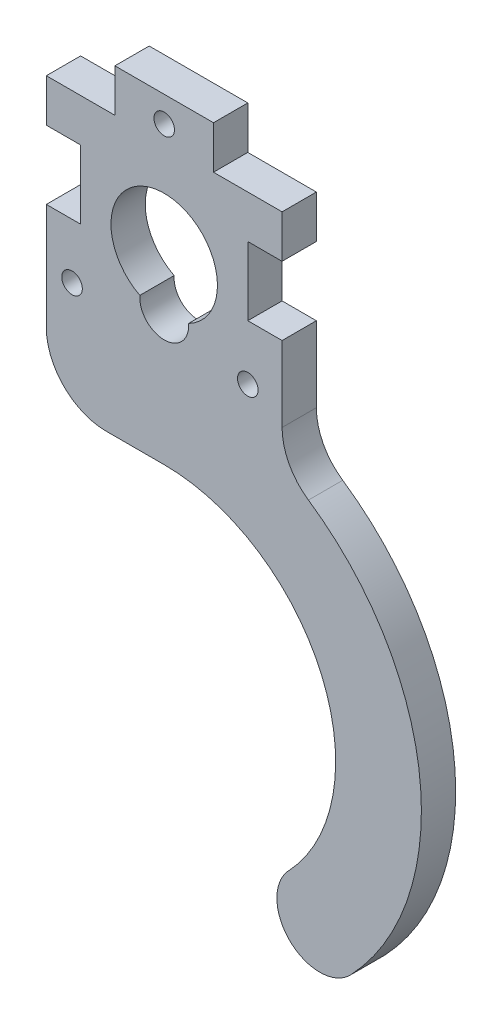
ISO-10303-21;
HEADER;
FILE_DESCRIPTION(('STEP AP214'),'2;1');
FILE_NAME('part.step','',(''),(''),'','','');
FILE_SCHEMA(('AUTOMOTIVE_DESIGN { 1 0 10303 214 1 1 1 1 }'));
ENDSEC;
DATA;
#1=APPLICATION_CONTEXT('core data for automotive mechanical design processes');
#2=APPLICATION_PROTOCOL_DEFINITION('international standard','automotive_design',2000,#1);
#3=PRODUCT_CONTEXT('',#1,'mechanical');
#4=PRODUCT('Part','Part','',(#3));
#5=PRODUCT_RELATED_PRODUCT_CATEGORY('part','',(#4));
#6=PRODUCT_DEFINITION_FORMATION('','',#4);
#7=PRODUCT_DEFINITION_CONTEXT('part definition',#1,'design');
#8=PRODUCT_DEFINITION('design','',#6,#7);
#9=PRODUCT_DEFINITION_SHAPE('','',#8);
#10=(LENGTH_UNIT() NAMED_UNIT(*) SI_UNIT(.MILLI.,.METRE.));
#11=(NAMED_UNIT(*) PLANE_ANGLE_UNIT() SI_UNIT($,.RADIAN.));
#12=(NAMED_UNIT(*) SI_UNIT($,.STERADIAN.) SOLID_ANGLE_UNIT());
#13=UNCERTAINTY_MEASURE_WITH_UNIT(LENGTH_MEASURE(1.E-05),#10,'distance_accuracy_value','');
#14=(GEOMETRIC_REPRESENTATION_CONTEXT(3) GLOBAL_UNCERTAINTY_ASSIGNED_CONTEXT((#13)) GLOBAL_UNIT_ASSIGNED_CONTEXT((#10,
#11,#12)) REPRESENTATION_CONTEXT('',''));
#15=CARTESIAN_POINT('',(0.,0.,0.));
#16=DIRECTION('',(0.,0.,1.));
#17=DIRECTION('',(1.,0.,0.));
#18=AXIS2_PLACEMENT_3D('',#15,#16,#17);
#19=CARTESIAN_POINT('',(35.5245474362626,-40.6365957450823,4.4));
#20=CARTESIAN_POINT('',(35.5245474362626,-40.6365957450823,4.26666666666604));
#21=CARTESIAN_POINT('',(35.5245474362636,-40.6365957450813,4.13333333333416));
#22=CARTESIAN_POINT('',(35.5245474362636,-40.6365957450813,2.66666666665839));
#23=CARTESIAN_POINT('',(35.5245474362636,-40.6365957450813,1.33333333333336));
#24=CARTESIAN_POINT('',(35.5245474362636,-40.6365957450813,-0.133333333333336));
#25=CARTESIAN_POINT('',(35.5245474362626,-40.6365957450823,-0.266666666666663));
#26=CARTESIAN_POINT('',(35.5245474362626,-40.6365957450823,-0.400000000000001));
#27=CARTESIAN_POINT('',(33.2315923534757,-43.0559899046674,4.4));
#28=CARTESIAN_POINT('',(33.2315923534757,-43.0559899046674,4.26666666666635));
#29=CARTESIAN_POINT('',(33.231592353477,-43.0559899046671,4.13333333333376));
#30=CARTESIAN_POINT('',(33.231592353477,-43.0559899046671,2.66666666666244));
#31=CARTESIAN_POINT('',(33.231592353477,-43.0559899046671,1.33333333333336));
#32=CARTESIAN_POINT('',(33.231592353477,-43.0559899046671,-0.133333333333336));
#33=CARTESIAN_POINT('',(33.2315923534757,-43.0559899046674,-0.266666666666663));
#34=CARTESIAN_POINT('',(33.2315923534757,-43.0559899046674,-0.400000000000001));
#35=CARTESIAN_POINT('',(28.5508528803031,-44.3605162920587,4.4));
#36=CARTESIAN_POINT('',(28.5508528803031,-44.3605162920587,4.266666666667));
#37=CARTESIAN_POINT('',(28.5508528803039,-44.3605162920594,4.13333333333289));
#38=CARTESIAN_POINT('',(28.5508528803013,-44.3605162920645,2.66666666667111));
#39=CARTESIAN_POINT('',(28.5508528803036,-44.3605162920598,1.33333333333336));
#40=CARTESIAN_POINT('',(28.5508528803036,-44.3605162920598,-0.133333333333336));
#41=CARTESIAN_POINT('',(28.5508528803031,-44.3605162920587,-0.266666666666663));
#42=CARTESIAN_POINT('',(28.5508528803031,-44.3605162920587,-0.400000000000001));
#43=CARTESIAN_POINT('',(24.9217616409256,-40.921083667878,4.4));
#44=CARTESIAN_POINT('',(24.9217616409256,-40.921083667878,4.26666666666748));
#45=CARTESIAN_POINT('',(24.9217616409262,-40.9210836678782,4.13333333333225));
#46=CARTESIAN_POINT('',(24.9217616409135,-40.9210836678833,2.66666666667747));
#47=CARTESIAN_POINT('',(24.921761640925,-40.9210836678787,1.33333333333336));
#48=CARTESIAN_POINT('',(24.921761640925,-40.9210836678787,-0.133333333333336));
#49=CARTESIAN_POINT('',(24.9217616409256,-40.921083667878,-0.266666666666663));
#50=CARTESIAN_POINT('',(24.9217616409256,-40.921083667878,-0.400000000000001));
#51=CARTESIAN_POINT('',(25.9734098747211,-36.1771246563064,4.4));
#52=CARTESIAN_POINT('',(25.9734098747211,-36.1771246563064,4.26666666666731));
#53=CARTESIAN_POINT('',(25.9734098747214,-36.1771246563061,4.13333333333248));
#54=CARTESIAN_POINT('',(25.9734098747188,-36.1771246563061,2.66666666667516));
#55=CARTESIAN_POINT('',(25.9734098747211,-36.1771246563061,1.33333333333336));
#56=CARTESIAN_POINT('',(25.9734098747211,-36.1771246563061,-0.133333333333336));
#57=CARTESIAN_POINT('',(25.9734098747211,-36.1771246563064,-0.266666666666663));
#58=CARTESIAN_POINT('',(25.9734098747211,-36.1771246563064,-0.400000000000001));
#59=CARTESIAN_POINT('',(28.2663649575083,-33.7577304967217,4.4));
#60=CARTESIAN_POINT('',(28.2663649575083,-33.7577304967217,4.266666666667));
#61=CARTESIAN_POINT('',(28.2663649575087,-33.7577304967212,4.13333333333289));
#62=CARTESIAN_POINT('',(28.2663649575087,-33.7577304967212,2.66666666667111));
#63=CARTESIAN_POINT('',(28.2663649575087,-33.7577304967212,1.33333333333336));
#64=CARTESIAN_POINT('',(28.2663649575087,-33.7577304967212,-0.133333333333336));
#65=CARTESIAN_POINT('',(28.2663649575083,-33.7577304967217,-0.266666666666663));
#66=CARTESIAN_POINT('',(28.2663649575083,-33.7577304967217,-0.400000000000001));
#67=(BOUNDED_SURFACE() B_SPLINE_SURFACE(5,3,((#19,#20,#21,#22,#23,#24,#25,#26),(#27,#28,#29,#30,
#31,#32,#33,#34),(#35,#36,#37,#38,#39,#40,#41,#42),(#43,#44,#45,#46,#47,#48,#49,#50),(#51,#52,
#53,#54,#55,#56,#57,#58),(#59,#60,#61,#62,#63,#64,#65,#66)),.UNSPECIFIED.,.F.,.F.,
.F.) B_SPLINE_SURFACE_WITH_KNOTS((6,6),(4,2,2,4),(0.,1.),(-0.1,0.,1.,1.1),
.UNSPECIFIED.) GEOMETRIC_REPRESENTATION_ITEM() RATIONAL_B_SPLINE_SURFACE(((1.,1.,1.,1.,1.,1.,1.,
1.),(0.599999999999972,0.599999999999972,0.599999999999916,0.599999999999916,0.599999999999916,
0.599999999999916,0.599999999999972,0.599999999999972),(0.399999999999959,0.399999999999959,
0.399999999999875,0.399999999999875,0.399999999999875,0.399999999999875,0.399999999999959,
0.399999999999959),(0.399999999999959,0.399999999999959,0.399999999999875,0.399999999999875,
0.399999999999875,0.399999999999875,0.399999999999959,0.399999999999959),(0.599999999999972,
0.599999999999972,0.599999999999916,0.599999999999916,0.599999999999916,0.599999999999916,
0.599999999999972,0.599999999999972),(1.,1.,1.,1.,1.,1.,1.,1.))) REPRESENTATION_ITEM('') SURFACE());
#68=CARTESIAN_POINT('',(35.5245474362626,-40.6365957450823,-0.400000000000001));
#69=CARTESIAN_POINT('',(35.5245474362626,-40.6365957450823,-0.266666666666663));
#70=CARTESIAN_POINT('',(35.5245474362636,-40.6365957450813,-0.133333333333336));
#71=CARTESIAN_POINT('',(35.5245474362636,-40.6365957450813,1.33333333333336));
#72=CARTESIAN_POINT('',(35.5245474362636,-40.6365957450813,2.66666666665839));
#73=CARTESIAN_POINT('',(35.5245474362636,-40.6365957450813,4.13333333333416));
#74=CARTESIAN_POINT('',(35.5245474362626,-40.6365957450823,4.26666666666604));
#75=CARTESIAN_POINT('',(35.5245474362626,-40.6365957450823,4.4));
#76=(BOUNDED_CURVE() B_SPLINE_CURVE(3,(#68,#69,#70,#71,#72,#73,#74,#75),.UNSPECIFIED.,.F.,
.F.) B_SPLINE_CURVE_WITH_KNOTS((4,2,2,4),(-0.1,0.,1.,1.1),
.UNSPECIFIED.) CURVE() GEOMETRIC_REPRESENTATION_ITEM() RATIONAL_B_SPLINE_CURVE((1.,1.,1.,1.,1.,
1.,1.,1.)) REPRESENTATION_ITEM(''));
#77=CARTESIAN_POINT('',(35.5245474362636,-40.6365957450813,4.));
#78=VERTEX_POINT('',#77);
#79=CARTESIAN_POINT('',(35.5245474362636,-40.6365957450813,0.));
#80=VERTEX_POINT('',#79);
#81=EDGE_CURVE('E411',#78,#80,#76,.F.);
#82=CARTESIAN_POINT('',(35.5245474362636,-40.6365957450813,4.));
#83=CARTESIAN_POINT('',(33.231592353477,-43.0559899046671,4.));
#84=CARTESIAN_POINT('',(28.5508528803036,-44.3605162920598,4.));
#85=CARTESIAN_POINT('',(24.921761640925,-40.9210836678787,4.));
#86=CARTESIAN_POINT('',(25.9734098747211,-36.1771246563061,4.));
#87=CARTESIAN_POINT('',(28.2663649575087,-33.7577304967212,4.));
#88=(BOUNDED_CURVE() B_SPLINE_CURVE(5,(#82,#83,#84,#85,#86,#87),.UNSPECIFIED.,.F.,
.F.) B_SPLINE_CURVE_WITH_KNOTS((6,6),(0.,1.),
.UNSPECIFIED.) CURVE() GEOMETRIC_REPRESENTATION_ITEM() RATIONAL_B_SPLINE_CURVE((1.,
0.599999999999916,0.399999999999875,0.399999999999875,0.599999999999916,1.)) REPRESENTATION_ITEM(''));
#89=CARTESIAN_POINT('',(28.2663649575087,-33.7577304967212,4.));
#90=VERTEX_POINT('',#89);
#91=EDGE_CURVE('E55',#90,#78,#88,.F.);
#92=CARTESIAN_POINT('',(28.2663649575083,-33.7577304967217,4.4));
#93=CARTESIAN_POINT('',(28.2663649575083,-33.7577304967217,4.266666666667));
#94=CARTESIAN_POINT('',(28.2663649575087,-33.7577304967212,4.13333333333289));
#95=CARTESIAN_POINT('',(28.2663649575087,-33.7577304967212,2.66666666667111));
#96=CARTESIAN_POINT('',(28.2663649575087,-33.7577304967212,1.33333333333336));
#97=CARTESIAN_POINT('',(28.2663649575087,-33.7577304967212,-0.133333333333336));
#98=CARTESIAN_POINT('',(28.2663649575083,-33.7577304967217,-0.266666666666663));
#99=CARTESIAN_POINT('',(28.2663649575083,-33.7577304967217,-0.400000000000001));
#100=(BOUNDED_CURVE() B_SPLINE_CURVE(3,(#92,#93,#94,#95,#96,#97,#98,#99),.UNSPECIFIED.,.F.,
.F.) B_SPLINE_CURVE_WITH_KNOTS((4,2,2,4),(-0.1,0.,1.,1.1),
.UNSPECIFIED.) CURVE() GEOMETRIC_REPRESENTATION_ITEM() RATIONAL_B_SPLINE_CURVE((1.,1.,1.,1.,1.,
1.,1.,1.)) REPRESENTATION_ITEM(''));
#101=CARTESIAN_POINT('',(28.2663649575087,-33.7577304967212,0.));
#102=VERTEX_POINT('',#101);
#103=EDGE_CURVE('E310',#102,#90,#100,.F.);
#104=CARTESIAN_POINT('',(28.2663649575087,-33.7577304967212,0.));
#105=CARTESIAN_POINT('',(25.9734098747211,-36.1771246563061,0.));
#106=CARTESIAN_POINT('',(24.921761640925,-40.9210836678787,0.));
#107=CARTESIAN_POINT('',(28.5508528803036,-44.3605162920598,0.));
#108=CARTESIAN_POINT('',(33.231592353477,-43.0559899046671,0.));
#109=CARTESIAN_POINT('',(35.5245474362636,-40.6365957450813,0.));
#110=(BOUNDED_CURVE() B_SPLINE_CURVE(5,(#104,#105,#106,#107,#108,#109),.UNSPECIFIED.,.F.,
.F.) B_SPLINE_CURVE_WITH_KNOTS((6,6),(0.,1.),
.UNSPECIFIED.) CURVE() GEOMETRIC_REPRESENTATION_ITEM() RATIONAL_B_SPLINE_CURVE((1.,
0.599999999999916,0.399999999999875,0.399999999999875,0.599999999999916,1.)) REPRESENTATION_ITEM(''));
#111=EDGE_CURVE('E11',#80,#102,#110,.F.);
#112=ORIENTED_EDGE('',*,*,#81,.F.);
#113=ORIENTED_EDGE('',*,*,#91,.F.);
#114=ORIENTED_EDGE('',*,*,#103,.F.);
#115=ORIENTED_EDGE('',*,*,#111,.F.);
#116=EDGE_LOOP('',(#112,#113,#114,#115));
#117=FACE_BOUND('',#116,.T.);
#118=ADVANCED_FACE('F41',(#117),#67,.T.);
#119=CARTESIAN_POINT('',(23.5,0.,4.));
#120=DIRECTION('',(1.,0.,0.));
#121=DIRECTION('',(0.,1.,0.));
#122=AXIS2_PLACEMENT_3D('',#119,#120,#121);
#123=PLANE('',#122);
#124=DIRECTION('',(0.,-1.,0.));
#125=VECTOR('',#124,1.);
#126=CARTESIAN_POINT('',(23.5,0.,0.));
#127=LINE('',#126,#125);
#128=CARTESIAN_POINT('',(23.5,27.42,0.));
#129=VERTEX_POINT('',#128);
#130=CARTESIAN_POINT('',(23.5,19.42,0.));
#131=VERTEX_POINT('',#130);
#132=EDGE_CURVE('E557',#129,#131,#127,.T.);
#133=ORIENTED_EDGE('',*,*,#132,.F.);
#134=DIRECTION('',(0.,0.,-1.));
#135=VECTOR('',#134,1.);
#136=CARTESIAN_POINT('',(23.5,27.42,4.));
#137=LINE('',#136,#135);
#138=CARTESIAN_POINT('',(23.5,27.42,4.));
#139=VERTEX_POINT('',#138);
#140=EDGE_CURVE('E498',#139,#129,#137,.T.);
#141=ORIENTED_EDGE('',*,*,#140,.F.);
#142=DIRECTION('',(0.,-1.,0.));
#143=VECTOR('',#142,1.);
#144=CARTESIAN_POINT('',(23.5,0.,4.));
#145=LINE('',#144,#143);
#146=CARTESIAN_POINT('',(23.5,19.42,4.));
#147=VERTEX_POINT('',#146);
#148=EDGE_CURVE('E241',#139,#147,#145,.T.);
#149=ORIENTED_EDGE('',*,*,#148,.T.);
#150=DIRECTION('',(0.,0.,-1.));
#151=VECTOR('',#150,1.);
#152=CARTESIAN_POINT('',(23.5,19.42,4.));
#153=LINE('',#152,#151);
#154=EDGE_CURVE('E214',#147,#131,#153,.T.);
#155=ORIENTED_EDGE('',*,*,#154,.T.);
#156=EDGE_LOOP('',(#133,#141,#149,#155));
#157=FACE_BOUND('',#156,.T.);
#158=ADVANCED_FACE('F374',(#157),#123,.T.);
#159=CARTESIAN_POINT('',(0.,27.42,4.));
#160=DIRECTION('',(0.,-1.,0.));
#161=DIRECTION('',(0.,0.,-1.));
#162=AXIS2_PLACEMENT_3D('',#159,#160,#161);
#163=PLANE('',#162);
#164=DIRECTION('',(-1.,0.,0.));
#165=VECTOR('',#164,1.);
#166=CARTESIAN_POINT('',(0.,27.42,0.));
#167=LINE('',#166,#165);
#168=CARTESIAN_POINT('',(27.5,27.42,0.));
#169=VERTEX_POINT('',#168);
#170=EDGE_CURVE('E560',#169,#129,#167,.T.);
#171=ORIENTED_EDGE('',*,*,#170,.F.);
#172=DIRECTION('',(0.,0.,-1.));
#173=VECTOR('',#172,1.);
#174=CARTESIAN_POINT('',(27.5,27.42,4.));
#175=LINE('',#174,#173);
#176=CARTESIAN_POINT('',(27.5,27.42,4.));
#177=VERTEX_POINT('',#176);
#178=EDGE_CURVE('E495',#177,#169,#175,.T.);
#179=ORIENTED_EDGE('',*,*,#178,.F.);
#180=DIRECTION('',(-1.,0.,0.));
#181=VECTOR('',#180,1.);
#182=CARTESIAN_POINT('',(0.,27.42,4.));
#183=LINE('',#182,#181);
#184=EDGE_CURVE('E245',#177,#139,#183,.T.);
#185=ORIENTED_EDGE('',*,*,#184,.T.);
#186=ORIENTED_EDGE('',*,*,#140,.T.);
#187=EDGE_LOOP('',(#171,#179,#185,#186));
#188=FACE_BOUND('',#187,.T.);
#189=ADVANCED_FACE('F371',(#188),#163,.T.);
#190=CARTESIAN_POINT('',(27.5,0.,4.));
#191=DIRECTION('',(-1.,0.,0.));
#192=DIRECTION('',(0.,0.,1.));
#193=AXIS2_PLACEMENT_3D('',#190,#191,#192);
#194=PLANE('',#193);
#195=DIRECTION('',(0.,1.,0.));
#196=VECTOR('',#195,1.);
#197=CARTESIAN_POINT('',(27.5,0.,0.));
#198=LINE('',#197,#196);
#199=CARTESIAN_POINT('',(27.5,32.42,0.));
#200=VERTEX_POINT('',#199);
#201=EDGE_CURVE('E564',#169,#200,#198,.T.);
#202=ORIENTED_EDGE('',*,*,#201,.T.);
#203=DIRECTION('',(0.,0.,-1.));
#204=VECTOR('',#203,1.);
#205=CARTESIAN_POINT('',(27.5,32.42,4.));
#206=LINE('',#205,#204);
#207=CARTESIAN_POINT('',(27.5,32.42,4.));
#208=VERTEX_POINT('',#207);
#209=EDGE_CURVE('E491',#208,#200,#206,.T.);
#210=ORIENTED_EDGE('',*,*,#209,.F.);
#211=DIRECTION('',(0.,1.,0.));
#212=VECTOR('',#211,1.);
#213=CARTESIAN_POINT('',(27.5,0.,4.));
#214=LINE('',#213,#212);
#215=EDGE_CURVE('E249',#177,#208,#214,.T.);
#216=ORIENTED_EDGE('',*,*,#215,.F.);
#217=ORIENTED_EDGE('',*,*,#178,.T.);
#218=EDGE_LOOP('',(#202,#210,#216,#217));
#219=FACE_BOUND('',#218,.T.);
#220=ADVANCED_FACE('F369',(#219),#194,.F.);
#221=CARTESIAN_POINT('',(0.,32.42,4.));
#222=DIRECTION('',(0.,-1.,0.));
#223=DIRECTION('',(0.,0.,-1.));
#224=AXIS2_PLACEMENT_3D('',#221,#222,#223);
#225=PLANE('',#224);
#226=DIRECTION('',(-1.,0.,0.));
#227=VECTOR('',#226,1.);
#228=CARTESIAN_POINT('',(0.,32.42,0.));
#229=LINE('',#228,#227);
#230=CARTESIAN_POINT('',(19.5,32.42,0.));
#231=VERTEX_POINT('',#230);
#232=EDGE_CURVE('E568',#200,#231,#229,.T.);
#233=ORIENTED_EDGE('',*,*,#232,.T.);
#234=DIRECTION('',(0.,0.,-1.));
#235=VECTOR('',#234,1.);
#236=CARTESIAN_POINT('',(19.5,32.42,4.));
#237=LINE('',#236,#235);
#238=CARTESIAN_POINT('',(19.5,32.42,4.));
#239=VERTEX_POINT('',#238);
#240=EDGE_CURVE('E488',#239,#231,#237,.T.);
#241=ORIENTED_EDGE('',*,*,#240,.F.);
#242=DIRECTION('',(-1.,0.,0.));
#243=VECTOR('',#242,1.);
#244=CARTESIAN_POINT('',(0.,32.42,4.));
#245=LINE('',#244,#243);
#246=EDGE_CURVE('E253',#208,#239,#245,.T.);
#247=ORIENTED_EDGE('',*,*,#246,.F.);
#248=ORIENTED_EDGE('',*,*,#209,.T.);
#249=EDGE_LOOP('',(#233,#241,#247,#248));
#250=FACE_BOUND('',#249,.T.);
#251=ADVANCED_FACE('F365',(#250),#225,.F.);
#252=CARTESIAN_POINT('',(19.5,0.,4.));
#253=DIRECTION('',(1.,0.,0.));
#254=DIRECTION('',(0.,0.,-1.));
#255=AXIS2_PLACEMENT_3D('',#252,#253,#254);
#256=PLANE('',#255);
#257=DIRECTION('',(0.,-1.,0.));
#258=VECTOR('',#257,1.);
#259=CARTESIAN_POINT('',(19.5,0.,0.));
#260=LINE('',#259,#258);
#261=CARTESIAN_POINT('',(19.5,37.42,0.));
#262=VERTEX_POINT('',#261);
#263=EDGE_CURVE('E572',#262,#231,#260,.T.);
#264=ORIENTED_EDGE('',*,*,#263,.F.);
#265=DIRECTION('',(0.,0.,-1.));
#266=VECTOR('',#265,1.);
#267=CARTESIAN_POINT('',(19.5,37.42,4.));
#268=LINE('',#267,#266);
#269=CARTESIAN_POINT('',(19.5,37.42,4.));
#270=VERTEX_POINT('',#269);
#271=EDGE_CURVE('E485',#270,#262,#268,.T.);
#272=ORIENTED_EDGE('',*,*,#271,.F.);
#273=DIRECTION('',(0.,-1.,0.));
#274=VECTOR('',#273,1.);
#275=CARTESIAN_POINT('',(19.5,0.,4.));
#276=LINE('',#275,#274);
#277=EDGE_CURVE('E257',#270,#239,#276,.T.);
#278=ORIENTED_EDGE('',*,*,#277,.T.);
#279=ORIENTED_EDGE('',*,*,#240,.T.);
#280=EDGE_LOOP('',(#264,#272,#278,#279));
#281=FACE_BOUND('',#280,.T.);
#282=ADVANCED_FACE('F361',(#281),#256,.T.);
#283=CARTESIAN_POINT('',(0.,37.42,4.));
#284=DIRECTION('',(0.,1.,0.));
#285=DIRECTION('',(0.,0.,1.));
#286=AXIS2_PLACEMENT_3D('',#283,#284,#285);
#287=PLANE('',#286);
#288=DIRECTION('',(1.,0.,0.));
#289=VECTOR('',#288,1.);
#290=CARTESIAN_POINT('',(0.,37.42,0.));
#291=LINE('',#290,#289);
#292=CARTESIAN_POINT('',(8.,37.42,0.));
#293=VERTEX_POINT('',#292);
#294=EDGE_CURVE('E576',#293,#262,#291,.T.);
#295=ORIENTED_EDGE('',*,*,#294,.F.);
#296=DIRECTION('',(0.,0.,-1.));
#297=VECTOR('',#296,1.);
#298=CARTESIAN_POINT('',(8.,37.42,4.));
#299=LINE('',#298,#297);
#300=CARTESIAN_POINT('',(8.,37.42,4.));
#301=VERTEX_POINT('',#300);
#302=EDGE_CURVE('E482',#301,#293,#299,.T.);
#303=ORIENTED_EDGE('',*,*,#302,.F.);
#304=DIRECTION('',(1.,0.,0.));
#305=VECTOR('',#304,1.);
#306=CARTESIAN_POINT('',(0.,37.42,4.));
#307=LINE('',#306,#305);
#308=EDGE_CURVE('E261',#301,#270,#307,.T.);
#309=ORIENTED_EDGE('',*,*,#308,.T.);
#310=ORIENTED_EDGE('',*,*,#271,.T.);
#311=EDGE_LOOP('',(#295,#303,#309,#310));
#312=FACE_BOUND('',#311,.T.);
#313=ADVANCED_FACE('F357',(#312),#287,.T.);
#314=CARTESIAN_POINT('',(8.,0.,4.));
#315=DIRECTION('',(-1.,0.,0.));
#316=DIRECTION('',(0.,0.,1.));
#317=AXIS2_PLACEMENT_3D('',#314,#315,#316);
#318=PLANE('',#317);
#319=DIRECTION('',(0.,1.,0.));
#320=VECTOR('',#319,1.);
#321=CARTESIAN_POINT('',(8.,0.,0.));
#322=LINE('',#321,#320);
#323=CARTESIAN_POINT('',(8.,32.42,0.));
#324=VERTEX_POINT('',#323);
#325=EDGE_CURVE('E580',#324,#293,#322,.T.);
#326=ORIENTED_EDGE('',*,*,#325,.F.);
#327=DIRECTION('',(0.,0.,-1.));
#328=VECTOR('',#327,1.);
#329=CARTESIAN_POINT('',(8.,32.42,4.));
#330=LINE('',#329,#328);
#331=CARTESIAN_POINT('',(8.,32.42,4.));
#332=VERTEX_POINT('',#331);
#333=EDGE_CURVE('E479',#332,#324,#330,.T.);
#334=ORIENTED_EDGE('',*,*,#333,.F.);
#335=DIRECTION('',(0.,1.,0.));
#336=VECTOR('',#335,1.);
#337=CARTESIAN_POINT('',(8.,0.,4.));
#338=LINE('',#337,#336);
#339=EDGE_CURVE('E265',#332,#301,#338,.T.);
#340=ORIENTED_EDGE('',*,*,#339,.T.);
#341=ORIENTED_EDGE('',*,*,#302,.T.);
#342=EDGE_LOOP('',(#326,#334,#340,#341));
#343=FACE_BOUND('',#342,.T.);
#344=ADVANCED_FACE('F353',(#343),#318,.T.);
#345=CARTESIAN_POINT('',(0.,32.42,4.));
#346=DIRECTION('',(0.,1.,0.));
#347=DIRECTION('',(-1.,0.,0.));
#348=AXIS2_PLACEMENT_3D('',#345,#346,#347);
#349=PLANE('',#348);
#350=DIRECTION('',(1.,0.,0.));
#351=VECTOR('',#350,1.);
#352=CARTESIAN_POINT('',(0.,32.42,0.));
#353=LINE('',#352,#351);
#354=CARTESIAN_POINT('',(0.,32.42,0.));
#355=VERTEX_POINT('',#354);
#356=EDGE_CURVE('E584',#355,#324,#353,.T.);
#357=ORIENTED_EDGE('',*,*,#356,.F.);
#358=DIRECTION('',(0.,0.,-1.));
#359=VECTOR('',#358,1.);
#360=CARTESIAN_POINT('',(0.,32.42,4.));
#361=LINE('',#360,#359);
#362=CARTESIAN_POINT('',(0.,32.42,4.));
#363=VERTEX_POINT('',#362);
#364=EDGE_CURVE('E476',#363,#355,#361,.T.);
#365=ORIENTED_EDGE('',*,*,#364,.F.);
#366=DIRECTION('',(1.,0.,0.));
#367=VECTOR('',#366,1.);
#368=CARTESIAN_POINT('',(0.,32.42,4.));
#369=LINE('',#368,#367);
#370=EDGE_CURVE('E269',#363,#332,#369,.T.);
#371=ORIENTED_EDGE('',*,*,#370,.T.);
#372=ORIENTED_EDGE('',*,*,#333,.T.);
#373=EDGE_LOOP('',(#357,#365,#371,#372));
#374=FACE_BOUND('',#373,.T.);
#375=ADVANCED_FACE('F350',(#374),#349,.T.);
#376=CARTESIAN_POINT('',(0.,0.,4.));
#377=DIRECTION('',(-1.,0.,0.));
#378=DIRECTION('',(0.,0.,1.));
#379=AXIS2_PLACEMENT_3D('',#376,#377,#378);
#380=PLANE('',#379);
#381=DIRECTION('',(0.,1.,0.));
#382=VECTOR('',#381,1.);
#383=CARTESIAN_POINT('',(0.,0.,0.));
#384=LINE('',#383,#382);
#385=CARTESIAN_POINT('',(0.,27.42,0.));
#386=VERTEX_POINT('',#385);
#387=EDGE_CURVE('E588',#386,#355,#384,.T.);
#388=ORIENTED_EDGE('',*,*,#387,.F.);
#389=DIRECTION('',(0.,0.,-1.));
#390=VECTOR('',#389,1.);
#391=CARTESIAN_POINT('',(0.,27.42,4.));
#392=LINE('',#391,#390);
#393=CARTESIAN_POINT('',(0.,27.42,4.));
#394=VERTEX_POINT('',#393);
#395=EDGE_CURVE('E473',#394,#386,#392,.T.);
#396=ORIENTED_EDGE('',*,*,#395,.F.);
#397=DIRECTION('',(0.,1.,0.));
#398=VECTOR('',#397,1.);
#399=CARTESIAN_POINT('',(0.,0.,4.));
#400=LINE('',#399,#398);
#401=EDGE_CURVE('E273',#394,#363,#400,.T.);
#402=ORIENTED_EDGE('',*,*,#401,.T.);
#403=ORIENTED_EDGE('',*,*,#364,.T.);
#404=EDGE_LOOP('',(#388,#396,#402,#403));
#405=FACE_BOUND('',#404,.T.);
#406=ADVANCED_FACE('F338',(#405),#380,.T.);
#407=CARTESIAN_POINT('',(0.,27.42,4.));
#408=DIRECTION('',(0.,1.,0.));
#409=DIRECTION('',(0.,0.,1.));
#410=AXIS2_PLACEMENT_3D('',#407,#408,#409);
#411=PLANE('',#410);
#412=DIRECTION('',(1.,0.,0.));
#413=VECTOR('',#412,1.);
#414=CARTESIAN_POINT('',(0.,27.42,0.));
#415=LINE('',#414,#413);
#416=CARTESIAN_POINT('',(4.,27.42,0.));
#417=VERTEX_POINT('',#416);
#418=EDGE_CURVE('E592',#386,#417,#415,.T.);
#419=ORIENTED_EDGE('',*,*,#418,.T.);
#420=DIRECTION('',(0.,0.,-1.));
#421=VECTOR('',#420,1.);
#422=CARTESIAN_POINT('',(4.,27.42,4.));
#423=LINE('',#422,#421);
#424=CARTESIAN_POINT('',(4.,27.42,4.));
#425=VERTEX_POINT('',#424);
#426=EDGE_CURVE('E469',#425,#417,#423,.T.);
#427=ORIENTED_EDGE('',*,*,#426,.F.);
#428=DIRECTION('',(1.,0.,0.));
#429=VECTOR('',#428,1.);
#430=CARTESIAN_POINT('',(0.,27.42,4.));
#431=LINE('',#430,#429);
#432=EDGE_CURVE('E277',#394,#425,#431,.T.);
#433=ORIENTED_EDGE('',*,*,#432,.F.);
#434=ORIENTED_EDGE('',*,*,#395,.T.);
#435=EDGE_LOOP('',(#419,#427,#433,#434));
#436=FACE_BOUND('',#435,.T.);
#437=ADVANCED_FACE('F345',(#436),#411,.F.);
#438=CARTESIAN_POINT('',(4.,0.,4.));
#439=DIRECTION('',(1.,0.,0.));
#440=DIRECTION('',(0.,1.,0.));
#441=AXIS2_PLACEMENT_3D('',#438,#439,#440);
#442=PLANE('',#441);
#443=DIRECTION('',(0.,-1.,0.));
#444=VECTOR('',#443,1.);
#445=CARTESIAN_POINT('',(4.,0.,0.));
#446=LINE('',#445,#444);
#447=CARTESIAN_POINT('',(4.,19.42,0.));
#448=VERTEX_POINT('',#447);
#449=EDGE_CURVE('E597',#417,#448,#446,.T.);
#450=ORIENTED_EDGE('',*,*,#449,.T.);
#451=DIRECTION('',(0.,0.,-1.));
#452=VECTOR('',#451,1.);
#453=CARTESIAN_POINT('',(4.,19.42,4.));
#454=LINE('',#453,#452);
#455=CARTESIAN_POINT('',(4.,19.42,4.));
#456=VERTEX_POINT('',#455);
#457=EDGE_CURVE('E466',#456,#448,#454,.T.);
#458=ORIENTED_EDGE('',*,*,#457,.F.);
#459=DIRECTION('',(0.,-1.,0.));
#460=VECTOR('',#459,1.);
#461=CARTESIAN_POINT('',(4.,0.,4.));
#462=LINE('',#461,#460);
#463=EDGE_CURVE('E282',#425,#456,#462,.T.);
#464=ORIENTED_EDGE('',*,*,#463,.F.);
#465=ORIENTED_EDGE('',*,*,#426,.T.);
#466=EDGE_LOOP('',(#450,#458,#464,#465));
#467=FACE_BOUND('',#466,.T.);
#468=ADVANCED_FACE('F341',(#467),#442,.F.);
#469=CARTESIAN_POINT('',(0.,19.42,4.));
#470=DIRECTION('',(0.,1.,0.));
#471=DIRECTION('',(0.,0.,1.));
#472=AXIS2_PLACEMENT_3D('',#469,#470,#471);
#473=PLANE('',#472);
#474=DIRECTION('',(1.,0.,0.));
#475=VECTOR('',#474,1.);
#476=CARTESIAN_POINT('',(0.,19.42,0.));
#477=LINE('',#476,#475);
#478=CARTESIAN_POINT('',(0.,19.42,0.));
#479=VERTEX_POINT('',#478);
#480=EDGE_CURVE('E601',#479,#448,#477,.T.);
#481=ORIENTED_EDGE('',*,*,#480,.F.);
#482=DIRECTION('',(0.,0.,-1.));
#483=VECTOR('',#482,1.);
#484=CARTESIAN_POINT('',(0.,19.42,4.));
#485=LINE('',#484,#483);
#486=CARTESIAN_POINT('',(0.,19.42,4.));
#487=VERTEX_POINT('',#486);
#488=EDGE_CURVE('E462',#487,#479,#485,.T.);
#489=ORIENTED_EDGE('',*,*,#488,.F.);
#490=DIRECTION('',(1.,0.,0.));
#491=VECTOR('',#490,1.);
#492=CARTESIAN_POINT('',(0.,19.42,4.));
#493=LINE('',#492,#491);
#494=EDGE_CURVE('E285',#487,#456,#493,.T.);
#495=ORIENTED_EDGE('',*,*,#494,.T.);
#496=ORIENTED_EDGE('',*,*,#457,.T.);
#497=EDGE_LOOP('',(#481,#489,#495,#496));
#498=FACE_BOUND('',#497,.T.);
#499=ADVANCED_FACE('F336',(#498),#473,.T.);
#500=CARTESIAN_POINT('',(0.,7.,0.));
#501=VERTEX_POINT('',#500);
#502=EDGE_CURVE('E593',#501,#479,#384,.T.);
#503=ORIENTED_EDGE('',*,*,#502,.F.);
#504=DIRECTION('',(0.,0.,-1.));
#505=VECTOR('',#504,1.);
#506=CARTESIAN_POINT('',(0.,7.,4.));
#507=LINE('',#506,#505);
#508=CARTESIAN_POINT('',(0.,7.,4.));
#509=VERTEX_POINT('',#508);
#510=EDGE_CURVE('E516',#501,#509,#507,.F.);
#511=ORIENTED_EDGE('',*,*,#510,.T.);
#512=EDGE_CURVE('E278',#509,#487,#400,.T.);
#513=ORIENTED_EDGE('',*,*,#512,.T.);
#514=ORIENTED_EDGE('',*,*,#488,.T.);
#515=EDGE_LOOP('',(#503,#511,#513,#514));
#516=FACE_BOUND('',#515,.T.);
#517=ADVANCED_FACE('F332',(#516),#380,.T.);
#518=CARTESIAN_POINT('',(0.,0.,4.));
#519=DIRECTION('',(0.,1.,0.));
#520=DIRECTION('',(0.,0.,1.));
#521=AXIS2_PLACEMENT_3D('',#518,#519,#520);
#522=PLANE('',#521);
#523=DIRECTION('',(1.,0.,0.));
#524=VECTOR('',#523,1.);
#525=CARTESIAN_POINT('',(0.,0.,4.));
#526=LINE('',#525,#524);
#527=CARTESIAN_POINT('',(7.,0.,4.));
#528=VERTEX_POINT('',#527);
#529=CARTESIAN_POINT('',(13.75,0.,4.));
#530=VERTEX_POINT('',#529);
#531=EDGE_CURVE('E289',#528,#530,#526,.T.);
#532=ORIENTED_EDGE('',*,*,#531,.F.);
#533=DIRECTION('',(0.,0.,-1.));
#534=VECTOR('',#533,1.);
#535=CARTESIAN_POINT('',(7.,0.,0.));
#536=LINE('',#535,#534);
#537=CARTESIAN_POINT('',(7.,0.,0.));
#538=VERTEX_POINT('',#537);
#539=EDGE_CURVE('E509',#528,#538,#536,.T.);
#540=ORIENTED_EDGE('',*,*,#539,.T.);
#541=DIRECTION('',(1.,0.,0.));
#542=VECTOR('',#541,1.);
#543=CARTESIAN_POINT('',(0.,0.,0.));
#544=LINE('',#543,#542);
#545=CARTESIAN_POINT('',(13.75,0.,0.));
#546=VERTEX_POINT('',#545);
#547=EDGE_CURVE('E604',#538,#546,#544,.T.);
#548=ORIENTED_EDGE('',*,*,#547,.T.);
#549=DIRECTION('',(0.,0.,-1.));
#550=VECTOR('',#549,1.);
#551=CARTESIAN_POINT('',(13.75,0.,4.));
#552=LINE('',#551,#550);
#553=EDGE_CURVE('E458',#530,#546,#552,.T.);
#554=ORIENTED_EDGE('',*,*,#553,.F.);
#555=EDGE_LOOP('',(#532,#540,#548,#554));
#556=FACE_BOUND('',#555,.T.);
#557=ADVANCED_FACE('F327',(#556),#522,.F.);
#558=CARTESIAN_POINT('',(13.75,-20.,4.));
#559=DIRECTION('',(0.,0.,-1.));
#560=DIRECTION('',(-1.,0.,0.));
#561=AXIS2_PLACEMENT_3D('',#558,#559,#560);
#562=CYLINDRICAL_SURFACE('',#561,20.);
#563=CARTESIAN_POINT('',(13.75,-20.,0.));
#564=DIRECTION('',(0.,0.,1.));
#565=DIRECTION('',(1.,0.,0.));
#566=AXIS2_PLACEMENT_3D('',#563,#564,#565);
#567=CIRCLE('',#566,20.);
#568=EDGE_CURVE('E303',#546,#102,#567,.F.);
#569=ORIENTED_EDGE('',*,*,#568,.T.);
#570=ORIENTED_EDGE('',*,*,#103,.T.);
#571=CARTESIAN_POINT('',(13.75,-20.,4.));
#572=DIRECTION('',(0.,0.,1.));
#573=DIRECTION('',(1.,0.,0.));
#574=AXIS2_PLACEMENT_3D('',#571,#572,#573);
#575=CIRCLE('',#574,20.);
#576=EDGE_CURVE('E292',#530,#90,#575,.F.);
#577=ORIENTED_EDGE('',*,*,#576,.F.);
#578=ORIENTED_EDGE('',*,*,#553,.T.);
#579=EDGE_LOOP('',(#569,#570,#577,#578));
#580=FACE_BOUND('',#579,.T.);
#581=ADVANCED_FACE('F316',(#580),#562,.F.);
#582=CARTESIAN_POINT('',(13.75,-20.,4.));
#583=DIRECTION('',(0.,0.,-1.));
#584=DIRECTION('',(-1.,0.,0.));
#585=AXIS2_PLACEMENT_3D('',#582,#583,#584);
#586=CYLINDRICAL_SURFACE('',#585,30.);
#587=CARTESIAN_POINT('',(13.75,-20.,4.));
#588=DIRECTION('',(0.,0.,1.));
#589=DIRECTION('',(1.,0.,0.));
#590=AXIS2_PLACEMENT_3D('',#587,#588,#589);
#591=CIRCLE('',#590,30.);
#592=CARTESIAN_POINT('',(30.5743243243243,4.83831940832448,4.));
#593=VERTEX_POINT('',#592);
#594=EDGE_CURVE('E302',#593,#78,#591,.F.);
#595=ORIENTED_EDGE('',*,*,#594,.T.);
#596=ORIENTED_EDGE('',*,*,#81,.T.);
#597=CARTESIAN_POINT('',(13.75,-20.,0.));
#598=DIRECTION('',(0.,0.,1.));
#599=DIRECTION('',(1.,0.,0.));
#600=AXIS2_PLACEMENT_3D('',#597,#598,#599);
#601=CIRCLE('',#600,30.);
#602=CARTESIAN_POINT('',(30.5743243243243,4.83831940832448,0.));
#603=VERTEX_POINT('',#602);
#604=EDGE_CURVE('E432',#603,#80,#601,.F.);
#605=ORIENTED_EDGE('',*,*,#604,.F.);
#606=DIRECTION('',(0.,0.,-1.));
#607=VECTOR('',#606,1.);
#608=CARTESIAN_POINT('',(30.5743243243243,4.83831940832448,4.));
#609=LINE('',#608,#607);
#610=EDGE_CURVE('E423',#603,#593,#609,.F.);
#611=ORIENTED_EDGE('',*,*,#610,.T.);
#612=EDGE_LOOP('',(#595,#596,#605,#611));
#613=FACE_BOUND('',#612,.T.);
#614=ADVANCED_FACE('F326',(#613),#586,.T.);
#615=CARTESIAN_POINT('',(27.5,10.6339272702669,4.));
#616=VERTEX_POINT('',#615);
#617=CARTESIAN_POINT('',(27.5,19.42,4.));
#618=VERTEX_POINT('',#617);
#619=EDGE_CURVE('E254',#616,#618,#214,.T.);
#620=ORIENTED_EDGE('',*,*,#619,.F.);
#621=DIRECTION('',(0.,0.,-1.));
#622=VECTOR('',#621,1.);
#623=CARTESIAN_POINT('',(27.5,10.6339272702669,4.));
#624=LINE('',#623,#622);
#625=CARTESIAN_POINT('',(27.5,10.6339272702669,0.));
#626=VERTEX_POINT('',#625);
#627=EDGE_CURVE('E501',#616,#626,#624,.T.);
#628=ORIENTED_EDGE('',*,*,#627,.T.);
#629=CARTESIAN_POINT('',(27.5,19.42,0.));
#630=VERTEX_POINT('',#629);
#631=EDGE_CURVE('E443',#626,#630,#198,.T.);
#632=ORIENTED_EDGE('',*,*,#631,.T.);
#633=DIRECTION('',(0.,0.,-1.));
#634=VECTOR('',#633,1.);
#635=CARTESIAN_POINT('',(27.5,19.42,4.));
#636=LINE('',#635,#634);
#637=EDGE_CURVE('E454',#618,#630,#636,.T.);
#638=ORIENTED_EDGE('',*,*,#637,.F.);
#639=EDGE_LOOP('',(#620,#628,#632,#638));
#640=FACE_BOUND('',#639,.T.);
#641=ADVANCED_FACE('F396',(#640),#194,.F.);
#642=CARTESIAN_POINT('',(13.75,21.21,4.));
#643=DIRECTION('',(0.,0.,-1.));
#644=DIRECTION('',(-1.,0.,0.));
#645=AXIS2_PLACEMENT_3D('',#642,#643,#644);
#646=CYLINDRICAL_SURFACE('',#645,6.21);
#647=CARTESIAN_POINT('',(13.75,21.21,0.));
#648=DIRECTION('',(0.,0.,1.));
#649=DIRECTION('',(1.,0.,0.));
#650=AXIS2_PLACEMENT_3D('',#647,#648,#649);
#651=CIRCLE('',#650,6.21);
#652=CARTESIAN_POINT('',(16.5908730362763,15.6879043478261,0.));
#653=VERTEX_POINT('',#652);
#654=CARTESIAN_POINT('',(10.9091269637237,15.6879043478261,0.));
#655=VERTEX_POINT('',#654);
#656=EDGE_CURVE('E208',#653,#655,#651,.T.);
#657=ORIENTED_EDGE('',*,*,#656,.F.);
#658=DIRECTION('',(0.,0.,-1.));
#659=VECTOR('',#658,1.);
#660=CARTESIAN_POINT('',(16.5908730362763,15.6879043478261,4.));
#661=LINE('',#660,#659);
#662=CARTESIAN_POINT('',(16.5908730362763,15.6879043478261,4.));
#663=VERTEX_POINT('',#662);
#664=EDGE_CURVE('E202',#663,#653,#661,.T.);
#665=ORIENTED_EDGE('',*,*,#664,.F.);
#666=CARTESIAN_POINT('',(13.75,21.21,4.));
#667=DIRECTION('',(0.,0.,1.));
#668=DIRECTION('',(1.,0.,0.));
#669=AXIS2_PLACEMENT_3D('',#666,#667,#668);
#670=CIRCLE('',#669,6.21);
#671=CARTESIAN_POINT('',(10.9091269637237,15.6879043478261,4.));
#672=VERTEX_POINT('',#671);
#673=EDGE_CURVE('E205',#663,#672,#670,.T.);
#674=ORIENTED_EDGE('',*,*,#673,.T.);
#675=DIRECTION('',(0.,0.,-1.));
#676=VECTOR('',#675,1.);
#677=CARTESIAN_POINT('',(10.9091269637237,15.6879043478261,4.));
#678=LINE('',#677,#676);
#679=EDGE_CURVE('E215',#672,#655,#678,.T.);
#680=ORIENTED_EDGE('',*,*,#679,.T.);
#681=EDGE_LOOP('',(#657,#665,#674,#680));
#682=FACE_BOUND('',#681,.T.);
#683=ADVANCED_FACE('F204',(#682),#646,.F.);
#684=CARTESIAN_POINT('',(3.,13.,4.));
#685=DIRECTION('',(0.,0.,-1.));
#686=DIRECTION('',(-1.,0.,0.));
#687=AXIS2_PLACEMENT_3D('',#684,#685,#686);
#688=CYLINDRICAL_SURFACE('',#687,1.2);
#689=CARTESIAN_POINT('',(3.,13.,4.));
#690=DIRECTION('',(0.,0.,1.));
#691=DIRECTION('',(1.,0.,0.));
#692=AXIS2_PLACEMENT_3D('',#689,#690,#691);
#693=CIRCLE('',#692,1.2);
#694=CARTESIAN_POINT('',(4.2,13.,4.));
#695=VERTEX_POINT('',#694);
#696=EDGE_CURVE('E237',#695,#695,#693,.T.);
#697=ORIENTED_EDGE('',*,*,#696,.T.);
#698=EDGE_LOOP('',(#697));
#699=FACE_BOUND('',#698,.T.);
#700=CARTESIAN_POINT('',(3.,13.,0.));
#701=DIRECTION('',(0.,0.,1.));
#702=DIRECTION('',(1.,0.,0.));
#703=AXIS2_PLACEMENT_3D('',#700,#701,#702);
#704=CIRCLE('',#703,1.2);
#705=CARTESIAN_POINT('',(4.2,13.,0.));
#706=VERTEX_POINT('',#705);
#707=EDGE_CURVE('E553',#706,#706,#704,.T.);
#708=ORIENTED_EDGE('',*,*,#707,.F.);
#709=EDGE_LOOP('',(#708));
#710=FACE_BOUND('',#709,.T.);
#711=ADVANCED_FACE('F379',(#699,#710),#688,.F.);
#712=CARTESIAN_POINT('',(13.75,34.42,4.));
#713=DIRECTION('',(0.,0.,-1.));
#714=DIRECTION('',(-1.,0.,0.));
#715=AXIS2_PLACEMENT_3D('',#712,#713,#714);
#716=CYLINDRICAL_SURFACE('',#715,1.2);
#717=CARTESIAN_POINT('',(13.75,34.42,4.));
#718=DIRECTION('',(0.,0.,1.));
#719=DIRECTION('',(1.,0.,0.));
#720=AXIS2_PLACEMENT_3D('',#717,#718,#719);
#721=CIRCLE('',#720,1.2);
#722=CARTESIAN_POINT('',(14.95,34.42,4.));
#723=VERTEX_POINT('',#722);
#724=EDGE_CURVE('E231',#723,#723,#721,.T.);
#725=ORIENTED_EDGE('',*,*,#724,.T.);
#726=EDGE_LOOP('',(#725));
#727=FACE_BOUND('',#726,.T.);
#728=CARTESIAN_POINT('',(13.75,34.42,0.));
#729=DIRECTION('',(0.,0.,1.));
#730=DIRECTION('',(1.,0.,0.));
#731=AXIS2_PLACEMENT_3D('',#728,#729,#730);
#732=CIRCLE('',#731,1.2);
#733=CARTESIAN_POINT('',(14.95,34.42,0.));
#734=VERTEX_POINT('',#733);
#735=EDGE_CURVE('E549',#734,#734,#732,.T.);
#736=ORIENTED_EDGE('',*,*,#735,.F.);
#737=EDGE_LOOP('',(#736));
#738=FACE_BOUND('',#737,.T.);
#739=ADVANCED_FACE('F382',(#727,#738),#716,.F.);
#740=CARTESIAN_POINT('',(23.5,13.,4.));
#741=DIRECTION('',(0.,0.,-1.));
#742=DIRECTION('',(-1.,0.,0.));
#743=AXIS2_PLACEMENT_3D('',#740,#741,#742);
#744=CYLINDRICAL_SURFACE('',#743,1.2);
#745=CARTESIAN_POINT('',(23.5,13.,4.));
#746=DIRECTION('',(0.,0.,1.));
#747=DIRECTION('',(1.,0.,0.));
#748=AXIS2_PLACEMENT_3D('',#745,#746,#747);
#749=CIRCLE('',#748,1.2);
#750=CARTESIAN_POINT('',(24.7,13.,4.));
#751=VERTEX_POINT('',#750);
#752=EDGE_CURVE('E226',#751,#751,#749,.T.);
#753=ORIENTED_EDGE('',*,*,#752,.T.);
#754=EDGE_LOOP('',(#753));
#755=FACE_BOUND('',#754,.T.);
#756=CARTESIAN_POINT('',(23.5,13.,0.));
#757=DIRECTION('',(0.,0.,1.));
#758=DIRECTION('',(1.,0.,0.));
#759=AXIS2_PLACEMENT_3D('',#756,#757,#758);
#760=CIRCLE('',#759,1.2);
#761=CARTESIAN_POINT('',(24.7,13.,0.));
#762=VERTEX_POINT('',#761);
#763=EDGE_CURVE('E545',#762,#762,#760,.T.);
#764=ORIENTED_EDGE('',*,*,#763,.F.);
#765=EDGE_LOOP('',(#764));
#766=FACE_BOUND('',#765,.T.);
#767=ADVANCED_FACE('F386',(#755,#766),#744,.F.);
#768=CARTESIAN_POINT('',(13.75,15.46,4.));
#769=DIRECTION('',(0.,0.,-1.));
#770=DIRECTION('',(-1.,0.,0.));
#771=AXIS2_PLACEMENT_3D('',#768,#769,#770);
#772=CYLINDRICAL_SURFACE('',#771,2.85);
#773=CARTESIAN_POINT('',(13.75,15.46,0.));
#774=DIRECTION('',(0.,0.,1.));
#775=DIRECTION('',(1.,0.,0.));
#776=AXIS2_PLACEMENT_3D('',#773,#774,#775);
#777=CIRCLE('',#776,2.85);
#778=EDGE_CURVE('E542',#655,#653,#777,.T.);
#779=ORIENTED_EDGE('',*,*,#778,.F.);
#780=ORIENTED_EDGE('',*,*,#679,.F.);
#781=CARTESIAN_POINT('',(13.75,15.46,4.));
#782=DIRECTION('',(0.,0.,1.));
#783=DIRECTION('',(1.,0.,0.));
#784=AXIS2_PLACEMENT_3D('',#781,#782,#783);
#785=CIRCLE('',#784,2.85);
#786=EDGE_CURVE('E220',#672,#663,#785,.T.);
#787=ORIENTED_EDGE('',*,*,#786,.T.);
#788=ORIENTED_EDGE('',*,*,#664,.T.);
#789=EDGE_LOOP('',(#779,#780,#787,#788));
#790=FACE_BOUND('',#789,.T.);
#791=ADVANCED_FACE('F224',(#790),#772,.F.);
#792=CARTESIAN_POINT('',(0.,19.42,4.));
#793=DIRECTION('',(0.,-1.,0.));
#794=DIRECTION('',(0.,0.,-1.));
#795=AXIS2_PLACEMENT_3D('',#792,#793,#794);
#796=PLANE('',#795);
#797=DIRECTION('',(-1.,0.,0.));
#798=VECTOR('',#797,1.);
#799=CARTESIAN_POINT('',(0.,19.42,0.));
#800=LINE('',#799,#798);
#801=EDGE_CURVE('E222',#630,#131,#800,.T.);
#802=ORIENTED_EDGE('',*,*,#801,.T.);
#803=ORIENTED_EDGE('',*,*,#154,.F.);
#804=DIRECTION('',(-1.,0.,0.));
#805=VECTOR('',#804,1.);
#806=CARTESIAN_POINT('',(0.,19.42,4.));
#807=LINE('',#806,#805);
#808=EDGE_CURVE('E430',#618,#147,#807,.T.);
#809=ORIENTED_EDGE('',*,*,#808,.F.);
#810=ORIENTED_EDGE('',*,*,#637,.T.);
#811=EDGE_LOOP('',(#802,#803,#809,#810));
#812=FACE_BOUND('',#811,.T.);
#813=ADVANCED_FACE('F393',(#812),#796,.F.);
#814=CARTESIAN_POINT('',(0.,0.,4.));
#815=DIRECTION('',(0.,0.,1.));
#816=DIRECTION('',(1.,0.,0.));
#817=AXIS2_PLACEMENT_3D('',#814,#815,#816);
#818=PLANE('',#817);
#819=ORIENTED_EDGE('',*,*,#673,.F.);
#820=ORIENTED_EDGE('',*,*,#786,.F.);
#821=EDGE_LOOP('',(#819,#820));
#822=FACE_BOUND('',#821,.T.);
#823=ORIENTED_EDGE('',*,*,#752,.F.);
#824=EDGE_LOOP('',(#823));
#825=FACE_BOUND('',#824,.T.);
#826=ORIENTED_EDGE('',*,*,#724,.F.);
#827=EDGE_LOOP('',(#826));
#828=FACE_BOUND('',#827,.T.);
#829=ORIENTED_EDGE('',*,*,#696,.F.);
#830=EDGE_LOOP('',(#829));
#831=FACE_BOUND('',#830,.T.);
#832=ORIENTED_EDGE('',*,*,#576,.T.);
#833=ORIENTED_EDGE('',*,*,#91,.T.);
#834=ORIENTED_EDGE('',*,*,#594,.F.);
#835=CARTESIAN_POINT('',(34.5,10.6339272702669,4.));
#836=DIRECTION('',(0.,0.,1.));
#837=DIRECTION('',(1.,0.,0.));
#838=AXIS2_PLACEMENT_3D('',#835,#836,#837);
#839=CIRCLE('',#838,7.);
#840=EDGE_CURVE('E418',#593,#616,#839,.F.);
#841=ORIENTED_EDGE('',*,*,#840,.T.);
#842=ORIENTED_EDGE('',*,*,#619,.T.);
#843=ORIENTED_EDGE('',*,*,#808,.T.);
#844=ORIENTED_EDGE('',*,*,#148,.F.);
#845=ORIENTED_EDGE('',*,*,#184,.F.);
#846=ORIENTED_EDGE('',*,*,#215,.T.);
#847=ORIENTED_EDGE('',*,*,#246,.T.);
#848=ORIENTED_EDGE('',*,*,#277,.F.);
#849=ORIENTED_EDGE('',*,*,#308,.F.);
#850=ORIENTED_EDGE('',*,*,#339,.F.);
#851=ORIENTED_EDGE('',*,*,#370,.F.);
#852=ORIENTED_EDGE('',*,*,#401,.F.);
#853=ORIENTED_EDGE('',*,*,#432,.T.);
#854=ORIENTED_EDGE('',*,*,#463,.T.);
#855=ORIENTED_EDGE('',*,*,#494,.F.);
#856=ORIENTED_EDGE('',*,*,#512,.F.);
#857=CARTESIAN_POINT('',(7.,7.,4.));
#858=DIRECTION('',(0.,0.,1.));
#859=DIRECTION('',(1.,0.,0.));
#860=AXIS2_PLACEMENT_3D('',#857,#858,#859);
#861=CIRCLE('',#860,7.);
#862=EDGE_CURVE('E519',#509,#528,#861,.T.);
#863=ORIENTED_EDGE('',*,*,#862,.T.);
#864=ORIENTED_EDGE('',*,*,#531,.T.);
#865=EDGE_LOOP('',(#832,#833,#834,#841,#842,#843,#844,#845,#846,#847,#848,#849,#850,#851,#852,
#853,#854,#855,#856,#863,#864));
#866=FACE_BOUND('',#865,.T.);
#867=ADVANCED_FACE('F218',(#822,#825,#828,#831,#866),#818,.T.);
#868=CARTESIAN_POINT('',(0.,0.,0.));
#869=DIRECTION('',(0.,0.,1.));
#870=DIRECTION('',(1.,0.,0.));
#871=AXIS2_PLACEMENT_3D('',#868,#869,#870);
#872=PLANE('',#871);
#873=ORIENTED_EDGE('',*,*,#656,.T.);
#874=ORIENTED_EDGE('',*,*,#778,.T.);
#875=EDGE_LOOP('',(#873,#874));
#876=FACE_BOUND('',#875,.T.);
#877=ORIENTED_EDGE('',*,*,#763,.T.);
#878=EDGE_LOOP('',(#877));
#879=FACE_BOUND('',#878,.T.);
#880=ORIENTED_EDGE('',*,*,#735,.T.);
#881=EDGE_LOOP('',(#880));
#882=FACE_BOUND('',#881,.T.);
#883=ORIENTED_EDGE('',*,*,#707,.T.);
#884=EDGE_LOOP('',(#883));
#885=FACE_BOUND('',#884,.T.);
#886=ORIENTED_EDGE('',*,*,#604,.T.);
#887=ORIENTED_EDGE('',*,*,#111,.T.);
#888=ORIENTED_EDGE('',*,*,#568,.F.);
#889=ORIENTED_EDGE('',*,*,#547,.F.);
#890=CARTESIAN_POINT('',(7.,7.,0.));
#891=DIRECTION('',(0.,0.,1.));
#892=DIRECTION('',(1.,0.,0.));
#893=AXIS2_PLACEMENT_3D('',#890,#891,#892);
#894=CIRCLE('',#893,7.);
#895=EDGE_CURVE('E513',#538,#501,#894,.F.);
#896=ORIENTED_EDGE('',*,*,#895,.T.);
#897=ORIENTED_EDGE('',*,*,#502,.T.);
#898=ORIENTED_EDGE('',*,*,#480,.T.);
#899=ORIENTED_EDGE('',*,*,#449,.F.);
#900=ORIENTED_EDGE('',*,*,#418,.F.);
#901=ORIENTED_EDGE('',*,*,#387,.T.);
#902=ORIENTED_EDGE('',*,*,#356,.T.);
#903=ORIENTED_EDGE('',*,*,#325,.T.);
#904=ORIENTED_EDGE('',*,*,#294,.T.);
#905=ORIENTED_EDGE('',*,*,#263,.T.);
#906=ORIENTED_EDGE('',*,*,#232,.F.);
#907=ORIENTED_EDGE('',*,*,#201,.F.);
#908=ORIENTED_EDGE('',*,*,#170,.T.);
#909=ORIENTED_EDGE('',*,*,#132,.T.);
#910=ORIENTED_EDGE('',*,*,#801,.F.);
#911=ORIENTED_EDGE('',*,*,#631,.F.);
#912=CARTESIAN_POINT('',(34.5,10.6339272702669,0.));
#913=DIRECTION('',(0.,0.,1.));
#914=DIRECTION('',(1.,0.,0.));
#915=AXIS2_PLACEMENT_3D('',#912,#913,#914);
#916=CIRCLE('',#915,7.);
#917=EDGE_CURVE('E521',#626,#603,#916,.T.);
#918=ORIENTED_EDGE('',*,*,#917,.T.);
#919=EDGE_LOOP('',(#886,#887,#888,#889,#896,#897,#898,#899,#900,#901,#902,#903,#904,#905,#906,
#907,#908,#909,#910,#911,#918));
#920=FACE_BOUND('',#919,.T.);
#921=ADVANCED_FACE('F400',(#876,#879,#882,#885,#920),#872,.F.);
#922=CARTESIAN_POINT('',(34.5,10.6339272702669,4.));
#923=DIRECTION('',(0.,0.,-1.));
#924=DIRECTION('',(-1.,0.,0.));
#925=AXIS2_PLACEMENT_3D('',#922,#923,#924);
#926=CYLINDRICAL_SURFACE('',#925,7.);
#927=ORIENTED_EDGE('',*,*,#840,.F.);
#928=ORIENTED_EDGE('',*,*,#610,.F.);
#929=ORIENTED_EDGE('',*,*,#917,.F.);
#930=ORIENTED_EDGE('',*,*,#627,.F.);
#931=EDGE_LOOP('',(#927,#928,#929,#930));
#932=FACE_BOUND('',#931,.T.);
#933=ADVANCED_FACE('F397',(#932),#926,.F.);
#934=CARTESIAN_POINT('',(7.,7.,4.));
#935=DIRECTION('',(0.,0.,1.));
#936=DIRECTION('',(1.,0.,0.));
#937=AXIS2_PLACEMENT_3D('',#934,#935,#936);
#938=CYLINDRICAL_SURFACE('',#937,7.);
#939=ORIENTED_EDGE('',*,*,#862,.F.);
#940=ORIENTED_EDGE('',*,*,#510,.F.);
#941=ORIENTED_EDGE('',*,*,#895,.F.);
#942=ORIENTED_EDGE('',*,*,#539,.F.);
#943=EDGE_LOOP('',(#939,#940,#941,#942));
#944=FACE_BOUND('',#943,.T.);
#945=ADVANCED_FACE('F399',(#944),#938,.T.);
#946=CLOSED_SHELL('',(#118,#158,#189,#220,#251,#282,#313,#344,#375,#406,#437,#468,#499,#517,
#557,#581,#614,#641,#683,#711,#739,#767,#791,#813,#867,#921,#933,#945));
#947=MANIFOLD_SOLID_BREP('B2',#946);
#948=ADVANCED_BREP_SHAPE_REPRESENTATION('',(#18,#947),#14);
#949=SHAPE_DEFINITION_REPRESENTATION(#9,#948);
ENDSEC;
END-ISO-10303-21;
